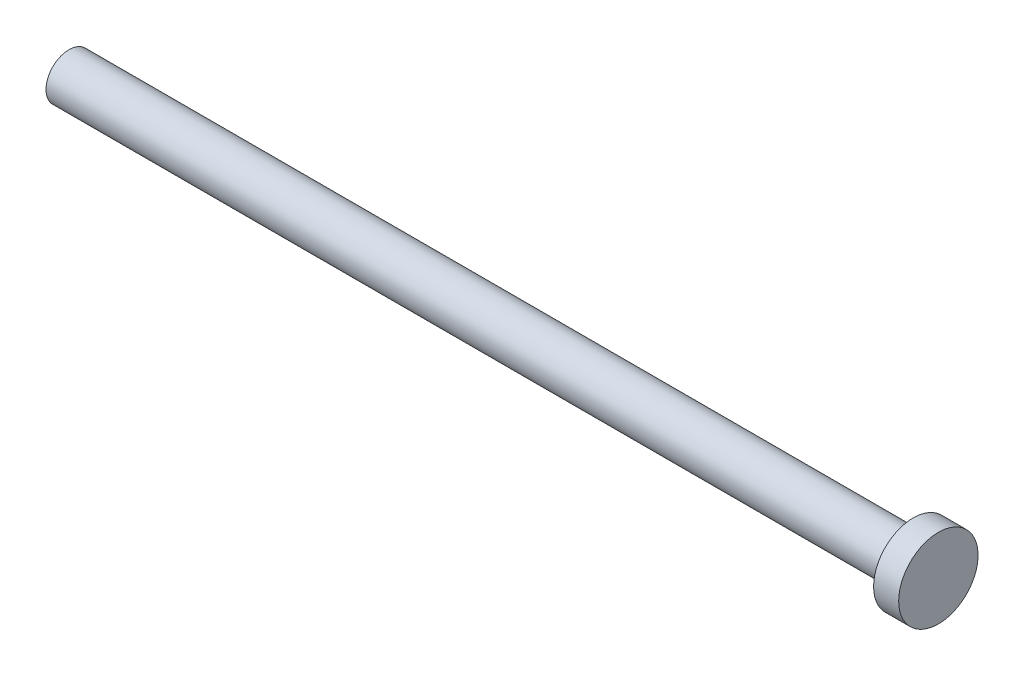
ISO-10303-21;
HEADER;
FILE_DESCRIPTION(('STEP AP214'),'2;1');
FILE_NAME('part.step','',(''),(''),'','','');
FILE_SCHEMA(('AUTOMOTIVE_DESIGN { 1 0 10303 214 1 1 1 1 }'));
ENDSEC;
DATA;
#1=APPLICATION_CONTEXT('core data for automotive mechanical design processes');
#2=APPLICATION_PROTOCOL_DEFINITION('international standard','automotive_design',2000,#1);
#3=PRODUCT_CONTEXT('',#1,'mechanical');
#4=PRODUCT('Part','Part','',(#3));
#5=PRODUCT_RELATED_PRODUCT_CATEGORY('part','',(#4));
#6=PRODUCT_DEFINITION_FORMATION('','',#4);
#7=PRODUCT_DEFINITION_CONTEXT('part definition',#1,'design');
#8=PRODUCT_DEFINITION('design','',#6,#7);
#9=PRODUCT_DEFINITION_SHAPE('','',#8);
#10=(LENGTH_UNIT() NAMED_UNIT(*) SI_UNIT(.MILLI.,.METRE.));
#11=(NAMED_UNIT(*) PLANE_ANGLE_UNIT() SI_UNIT($,.RADIAN.));
#12=(NAMED_UNIT(*) SI_UNIT($,.STERADIAN.) SOLID_ANGLE_UNIT());
#13=UNCERTAINTY_MEASURE_WITH_UNIT(LENGTH_MEASURE(1.E-05),#10,'distance_accuracy_value','');
#14=(GEOMETRIC_REPRESENTATION_CONTEXT(3) GLOBAL_UNCERTAINTY_ASSIGNED_CONTEXT((#13)) GLOBAL_UNIT_ASSIGNED_CONTEXT((#10,
#11,#12)) REPRESENTATION_CONTEXT('',''));
#15=CARTESIAN_POINT('',(0.,0.,0.));
#16=DIRECTION('',(0.,0.,1.));
#17=DIRECTION('',(1.,0.,0.));
#18=AXIS2_PLACEMENT_3D('',#15,#16,#17);
#19=CARTESIAN_POINT('',(-26.416,1.397,0.));
#20=DIRECTION('',(1.,0.,0.));
#21=DIRECTION('',(0.,0.,-1.));
#22=AXIS2_PLACEMENT_3D('',#19,#20,#21);
#23=PLANE('',#22);
#24=CARTESIAN_POINT('',(-26.416,0.,0.));
#25=DIRECTION('',(-1.,0.,0.));
#26=DIRECTION('',(0.,0.,1.));
#27=AXIS2_PLACEMENT_3D('',#24,#25,#26);
#28=CIRCLE('',#27,1.397);
#29=CARTESIAN_POINT('',(-26.416,0.,1.397));
#30=VERTEX_POINT('',#29);
#31=EDGE_CURVE('E44',#30,#30,#28,.T.);
#32=ORIENTED_EDGE('',*,*,#31,.T.);
#33=EDGE_LOOP('',(#32));
#34=FACE_BOUND('',#33,.T.);
#35=ADVANCED_FACE('F30',(#34),#23,.F.);
#36=CARTESIAN_POINT('',(26.416,0.,0.));
#37=DIRECTION('',(-1.,0.,0.));
#38=DIRECTION('',(0.,0.,1.));
#39=AXIS2_PLACEMENT_3D('',#36,#37,#38);
#40=PLANE('',#39);
#41=CARTESIAN_POINT('',(26.416,0.,0.));
#42=DIRECTION('',(-1.,0.,0.));
#43=DIRECTION('',(0.,0.,1.));
#44=AXIS2_PLACEMENT_3D('',#41,#42,#43);
#45=CIRCLE('',#44,2.413);
#46=CARTESIAN_POINT('',(26.416,0.,2.413));
#47=VERTEX_POINT('',#46);
#48=EDGE_CURVE('E10',#47,#47,#45,.T.);
#49=ORIENTED_EDGE('',*,*,#48,.F.);
#50=EDGE_LOOP('',(#49));
#51=FACE_BOUND('',#50,.T.);
#52=ADVANCED_FACE('F64',(#51),#40,.F.);
#53=CARTESIAN_POINT('',(-101.547873598434,0.,0.));
#54=DIRECTION('',(-1.,0.,0.));
#55=DIRECTION('',(0.,0.,1.));
#56=AXIS2_PLACEMENT_3D('',#53,#54,#55);
#57=CYLINDRICAL_SURFACE('',#56,2.413);
#58=CARTESIAN_POINT('',(24.892,0.,0.));
#59=DIRECTION('',(-1.,0.,0.));
#60=DIRECTION('',(0.,0.,1.));
#61=AXIS2_PLACEMENT_3D('',#58,#59,#60);
#62=CIRCLE('',#61,2.413);
#63=CARTESIAN_POINT('',(24.892,0.,2.413));
#64=VERTEX_POINT('',#63);
#65=EDGE_CURVE('E36',#64,#64,#62,.T.);
#66=ORIENTED_EDGE('',*,*,#65,.F.);
#67=EDGE_LOOP('',(#66));
#68=FACE_BOUND('',#67,.T.);
#69=ORIENTED_EDGE('',*,*,#48,.T.);
#70=EDGE_LOOP('',(#69));
#71=FACE_BOUND('',#70,.T.);
#72=ADVANCED_FACE('F59',(#68,#71),#57,.T.);
#73=CARTESIAN_POINT('',(24.892,2.413,0.));
#74=DIRECTION('',(1.,0.,0.));
#75=DIRECTION('',(0.,0.,-1.));
#76=AXIS2_PLACEMENT_3D('',#73,#74,#75);
#77=PLANE('',#76);
#78=CARTESIAN_POINT('',(24.892,0.,0.));
#79=DIRECTION('',(-1.,0.,0.));
#80=DIRECTION('',(0.,0.,1.));
#81=AXIS2_PLACEMENT_3D('',#78,#79,#80);
#82=CIRCLE('',#81,1.39700000000001);
#83=CARTESIAN_POINT('',(24.892,0.,1.39700000000001));
#84=VERTEX_POINT('',#83);
#85=EDGE_CURVE('E40',#84,#84,#82,.T.);
#86=ORIENTED_EDGE('',*,*,#85,.F.);
#87=EDGE_LOOP('',(#86));
#88=FACE_BOUND('',#87,.T.);
#89=ORIENTED_EDGE('',*,*,#65,.T.);
#90=EDGE_LOOP('',(#89));
#91=FACE_BOUND('',#90,.T.);
#92=ADVANCED_FACE('F54',(#88,#91),#77,.F.);
#93=CARTESIAN_POINT('',(-101.547873598434,0.,0.));
#94=DIRECTION('',(-1.,0.,0.));
#95=DIRECTION('',(0.,0.,1.));
#96=AXIS2_PLACEMENT_3D('',#93,#94,#95);
#97=CYLINDRICAL_SURFACE('',#96,1.397);
#98=ORIENTED_EDGE('',*,*,#31,.F.);
#99=EDGE_LOOP('',(#98));
#100=FACE_BOUND('',#99,.T.);
#101=ORIENTED_EDGE('',*,*,#85,.T.);
#102=EDGE_LOOP('',(#101));
#103=FACE_BOUND('',#102,.T.);
#104=ADVANCED_FACE('F51',(#100,#103),#97,.T.);
#105=CLOSED_SHELL('',(#35,#52,#72,#92,#104));
#106=MANIFOLD_SOLID_BREP('B2',#105);
#107=ADVANCED_BREP_SHAPE_REPRESENTATION('',(#18,#106),#14);
#108=SHAPE_DEFINITION_REPRESENTATION(#9,#107);
ENDSEC;
END-ISO-10303-21;
